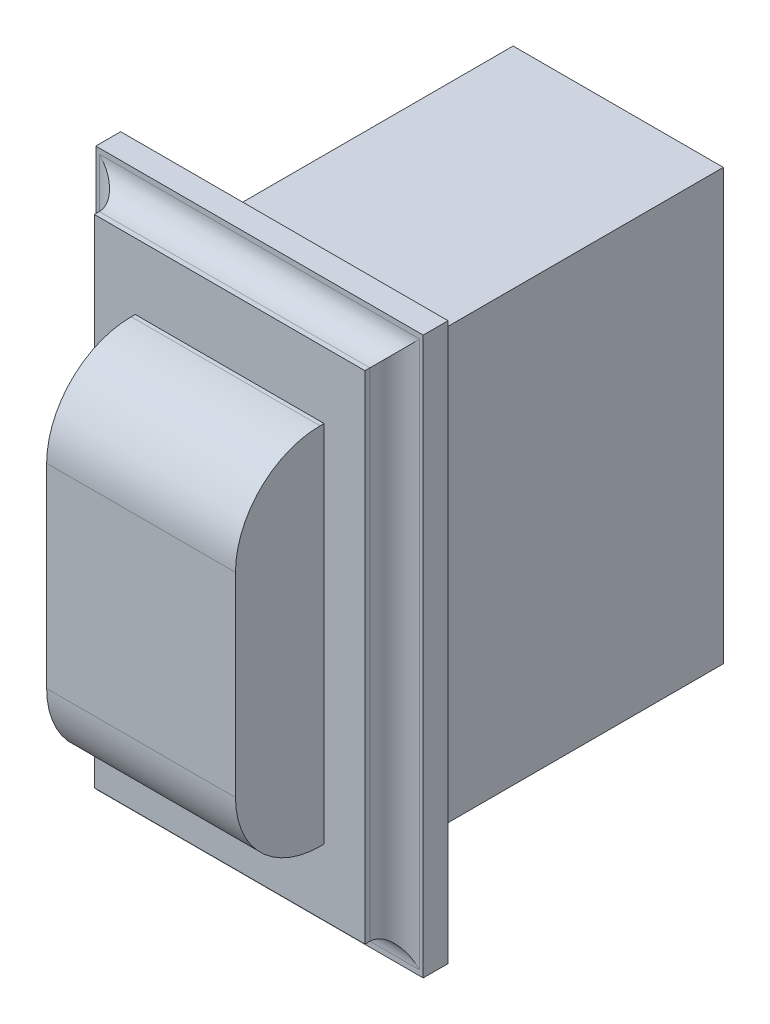
ISO-10303-21;
HEADER;
FILE_DESCRIPTION(('STEP AP214'),'2;1');
FILE_NAME('part.step','',(''),(''),'','','');
FILE_SCHEMA(('AUTOMOTIVE_DESIGN { 1 0 10303 214 1 1 1 1 }'));
ENDSEC;
DATA;
#1=APPLICATION_CONTEXT('core data for automotive mechanical design processes');
#2=APPLICATION_PROTOCOL_DEFINITION('international standard','automotive_design',2000,#1);
#3=PRODUCT_CONTEXT('',#1,'mechanical');
#4=PRODUCT('Part','Part','',(#3));
#5=PRODUCT_RELATED_PRODUCT_CATEGORY('part','',(#4));
#6=PRODUCT_DEFINITION_FORMATION('','',#4);
#7=PRODUCT_DEFINITION_CONTEXT('part definition',#1,'design');
#8=PRODUCT_DEFINITION('design','',#6,#7);
#9=PRODUCT_DEFINITION_SHAPE('','',#8);
#10=(LENGTH_UNIT() NAMED_UNIT(*) SI_UNIT(.MILLI.,.METRE.));
#11=(NAMED_UNIT(*) PLANE_ANGLE_UNIT() SI_UNIT($,.RADIAN.));
#12=(NAMED_UNIT(*) SI_UNIT($,.STERADIAN.) SOLID_ANGLE_UNIT());
#13=UNCERTAINTY_MEASURE_WITH_UNIT(LENGTH_MEASURE(1.E-05),#10,'distance_accuracy_value','');
#14=(GEOMETRIC_REPRESENTATION_CONTEXT(3) GLOBAL_UNCERTAINTY_ASSIGNED_CONTEXT((#13)) GLOBAL_UNIT_ASSIGNED_CONTEXT((#10,
#11,#12)) REPRESENTATION_CONTEXT('',''));
#15=CARTESIAN_POINT('',(0.,0.,0.));
#16=DIRECTION('',(0.,0.,1.));
#17=DIRECTION('',(1.,0.,0.));
#18=AXIS2_PLACEMENT_3D('',#15,#16,#17);
#19=CARTESIAN_POINT('',(0.,0.,0.));
#20=DIRECTION('',(0.,0.,1.));
#21=DIRECTION('',(1.,0.,0.));
#22=AXIS2_PLACEMENT_3D('',#19,#20,#21);
#23=PLANE('',#22);
#24=DIRECTION('',(0.,1.,0.));
#25=VECTOR('',#24,1.);
#26=CARTESIAN_POINT('',(16.7132,28.4226,0.));
#27=LINE('',#26,#25);
#28=CARTESIAN_POINT('',(16.7132,-28.4226,0.));
#29=VERTEX_POINT('',#28);
#30=CARTESIAN_POINT('',(16.7132,28.4226,0.));
#31=VERTEX_POINT('',#30);
#32=EDGE_CURVE('E248',#29,#31,#27,.T.);
#33=ORIENTED_EDGE('',*,*,#32,.F.);
#34=DIRECTION('',(1.,0.,0.));
#35=VECTOR('',#34,1.);
#36=CARTESIAN_POINT('',(-16.7132,-28.4226,0.));
#37=LINE('',#36,#35);
#38=CARTESIAN_POINT('',(-16.7132,-28.4226,0.));
#39=VERTEX_POINT('',#38);
#40=EDGE_CURVE('E253',#39,#29,#37,.T.);
#41=ORIENTED_EDGE('',*,*,#40,.F.);
#42=DIRECTION('',(0.,-1.,0.));
#43=VECTOR('',#42,1.);
#44=CARTESIAN_POINT('',(-16.7132,28.4226,0.));
#45=LINE('',#44,#43);
#46=CARTESIAN_POINT('',(-16.7132,28.4226,0.));
#47=VERTEX_POINT('',#46);
#48=EDGE_CURVE('E264',#47,#39,#45,.T.);
#49=ORIENTED_EDGE('',*,*,#48,.F.);
#50=DIRECTION('',(-1.,0.,0.));
#51=VECTOR('',#50,1.);
#52=CARTESIAN_POINT('',(-16.7132,28.4226,0.));
#53=LINE('',#52,#51);
#54=EDGE_CURVE('E262',#31,#47,#53,.T.);
#55=ORIENTED_EDGE('',*,*,#54,.F.);
#56=EDGE_LOOP('',(#33,#41,#49,#55));
#57=FACE_BOUND('',#56,.T.);
#58=DIRECTION('',(0.,1.,0.));
#59=VECTOR('',#58,1.);
#60=CARTESIAN_POINT('',(-10.7315,-21.9456,0.));
#61=LINE('',#60,#59);
#62=CARTESIAN_POINT('',(-10.7315,-21.9456,0.));
#63=VERTEX_POINT('',#62);
#64=CARTESIAN_POINT('',(-10.7315,21.9456,0.));
#65=VERTEX_POINT('',#64);
#66=EDGE_CURVE('E191',#63,#65,#61,.T.);
#67=ORIENTED_EDGE('',*,*,#66,.F.);
#68=DIRECTION('',(-1.,0.,0.));
#69=VECTOR('',#68,1.);
#70=CARTESIAN_POINT('',(10.7315,-21.9456,0.));
#71=LINE('',#70,#69);
#72=CARTESIAN_POINT('',(10.7315,-21.9456,0.));
#73=VERTEX_POINT('',#72);
#74=EDGE_CURVE('E188',#73,#63,#71,.T.);
#75=ORIENTED_EDGE('',*,*,#74,.F.);
#76=DIRECTION('',(0.,-1.,0.));
#77=VECTOR('',#76,1.);
#78=CARTESIAN_POINT('',(10.7315,-21.9456,0.));
#79=LINE('',#78,#77);
#80=CARTESIAN_POINT('',(10.7315,21.9456,0.));
#81=VERTEX_POINT('',#80);
#82=EDGE_CURVE('E55',#81,#73,#79,.T.);
#83=ORIENTED_EDGE('',*,*,#82,.F.);
#84=DIRECTION('',(1.,0.,0.));
#85=VECTOR('',#84,1.);
#86=CARTESIAN_POINT('',(10.7315,21.9456,0.));
#87=LINE('',#86,#85);
#88=EDGE_CURVE('E50',#65,#81,#87,.T.);
#89=ORIENTED_EDGE('',*,*,#88,.F.);
#90=EDGE_LOOP('',(#67,#75,#83,#89));
#91=FACE_BOUND('',#90,.T.);
#92=ADVANCED_FACE('F35',(#57,#91),#23,.F.);
#93=CARTESIAN_POINT('',(0.,0.,5.588));
#94=DIRECTION('',(0.,0.,1.));
#95=DIRECTION('',(1.,0.,0.));
#96=AXIS2_PLACEMENT_3D('',#93,#94,#95);
#97=PLANE('',#96);
#98=DIRECTION('',(0.,1.,0.));
#99=VECTOR('',#98,1.);
#100=CARTESIAN_POINT('',(13.8176,25.3492,5.588));
#101=LINE('',#100,#99);
#102=CARTESIAN_POINT('',(13.8176,-25.3492,5.588));
#103=VERTEX_POINT('',#102);
#104=CARTESIAN_POINT('',(13.8176,25.3492,5.588));
#105=VERTEX_POINT('',#104);
#106=EDGE_CURVE('E227',#103,#105,#101,.T.);
#107=ORIENTED_EDGE('',*,*,#106,.T.);
#108=DIRECTION('',(-1.,0.,0.));
#109=VECTOR('',#108,1.);
#110=CARTESIAN_POINT('',(-13.8176,25.3492,5.588));
#111=LINE('',#110,#109);
#112=CARTESIAN_POINT('',(-13.8176,25.3492,5.588));
#113=VERTEX_POINT('',#112);
#114=EDGE_CURVE('E230',#105,#113,#111,.T.);
#115=ORIENTED_EDGE('',*,*,#114,.T.);
#116=DIRECTION('',(0.,-1.,0.));
#117=VECTOR('',#116,1.);
#118=CARTESIAN_POINT('',(-13.8176,25.3492,5.588));
#119=LINE('',#118,#117);
#120=CARTESIAN_POINT('',(-13.8176,-25.3492,5.588));
#121=VERTEX_POINT('',#120);
#122=EDGE_CURVE('E232',#113,#121,#119,.T.);
#123=ORIENTED_EDGE('',*,*,#122,.T.);
#124=DIRECTION('',(1.,0.,0.));
#125=VECTOR('',#124,1.);
#126=CARTESIAN_POINT('',(-13.8176,-25.3492,5.588));
#127=LINE('',#126,#125);
#128=EDGE_CURVE('E234',#121,#103,#127,.T.);
#129=ORIENTED_EDGE('',*,*,#128,.T.);
#130=EDGE_LOOP('',(#107,#115,#123,#129));
#131=FACE_BOUND('',#130,.T.);
#132=DIRECTION('',(-1.,0.,0.));
#133=VECTOR('',#132,1.);
#134=CARTESIAN_POINT('',(-9.6393,18.5928,5.588));
#135=LINE('',#134,#133);
#136=CARTESIAN_POINT('',(9.6393,18.5928,5.588));
#137=VERTEX_POINT('',#136);
#138=CARTESIAN_POINT('',(-9.6393,18.5928,5.588));
#139=VERTEX_POINT('',#138);
#140=EDGE_CURVE('E211',#137,#139,#135,.T.);
#141=ORIENTED_EDGE('',*,*,#140,.F.);
#142=DIRECTION('',(0.,1.,0.));
#143=VECTOR('',#142,1.);
#144=CARTESIAN_POINT('',(9.6393,18.5928,5.588));
#145=LINE('',#144,#143);
#146=CARTESIAN_POINT('',(9.6393,-18.5928,5.588));
#147=VERTEX_POINT('',#146);
#148=EDGE_CURVE('E208',#147,#137,#145,.T.);
#149=ORIENTED_EDGE('',*,*,#148,.F.);
#150=DIRECTION('',(1.,0.,0.));
#151=VECTOR('',#150,1.);
#152=CARTESIAN_POINT('',(-9.6393,-18.5928,5.588));
#153=LINE('',#152,#151);
#154=CARTESIAN_POINT('',(-9.6393,-18.5928,5.588));
#155=VERTEX_POINT('',#154);
#156=EDGE_CURVE('E204',#155,#147,#153,.T.);
#157=ORIENTED_EDGE('',*,*,#156,.F.);
#158=DIRECTION('',(0.,-1.,0.));
#159=VECTOR('',#158,1.);
#160=CARTESIAN_POINT('',(-9.6393,18.5928,5.588));
#161=LINE('',#160,#159);
#162=EDGE_CURVE('E215',#139,#155,#161,.T.);
#163=ORIENTED_EDGE('',*,*,#162,.F.);
#164=EDGE_LOOP('',(#141,#149,#157,#163));
#165=FACE_BOUND('',#164,.T.);
#166=ADVANCED_FACE('F338',(#131,#165),#97,.T.);
#167=CARTESIAN_POINT('',(0.,0.,2.54));
#168=DIRECTION('',(0.,0.,1.));
#169=DIRECTION('',(1.,0.,0.));
#170=AXIS2_PLACEMENT_3D('',#167,#168,#169);
#171=PLANE('',#170);
#172=DIRECTION('',(0.,-1.,0.));
#173=VECTOR('',#172,1.);
#174=CARTESIAN_POINT('',(-16.3576,0.,2.54));
#175=LINE('',#174,#173);
#176=CARTESIAN_POINT('',(-16.3576,-27.8892,2.54));
#177=VERTEX_POINT('',#176);
#178=CARTESIAN_POINT('',(-16.3576,27.8892,2.54));
#179=VERTEX_POINT('',#178);
#180=EDGE_CURVE('E285',#177,#179,#175,.F.);
#181=ORIENTED_EDGE('',*,*,#180,.T.);
#182=DIRECTION('',(-1.,0.,0.));
#183=VECTOR('',#182,1.);
#184=CARTESIAN_POINT('',(0.,27.8892,2.54));
#185=LINE('',#184,#183);
#186=CARTESIAN_POINT('',(16.3576,27.8892,2.54));
#187=VERTEX_POINT('',#186);
#188=EDGE_CURVE('E287',#179,#187,#185,.F.);
#189=ORIENTED_EDGE('',*,*,#188,.T.);
#190=DIRECTION('',(0.,1.,0.));
#191=VECTOR('',#190,1.);
#192=CARTESIAN_POINT('',(16.3576,0.,2.54));
#193=LINE('',#192,#191);
#194=CARTESIAN_POINT('',(16.3576,-27.8892,2.54));
#195=VERTEX_POINT('',#194);
#196=EDGE_CURVE('E281',#187,#195,#193,.F.);
#197=ORIENTED_EDGE('',*,*,#196,.T.);
#198=DIRECTION('',(1.,0.,0.));
#199=VECTOR('',#198,1.);
#200=CARTESIAN_POINT('',(0.,-27.8892,2.54));
#201=LINE('',#200,#199);
#202=EDGE_CURVE('E283',#195,#177,#201,.F.);
#203=ORIENTED_EDGE('',*,*,#202,.T.);
#204=EDGE_LOOP('',(#181,#189,#197,#203));
#205=FACE_BOUND('',#204,.T.);
#206=DIRECTION('',(0.,1.,0.));
#207=VECTOR('',#206,1.);
#208=CARTESIAN_POINT('',(16.7132,28.4226,2.54));
#209=LINE('',#208,#207);
#210=CARTESIAN_POINT('',(16.7132,-28.4226,2.54));
#211=VERTEX_POINT('',#210);
#212=CARTESIAN_POINT('',(16.7132,28.4226,2.54));
#213=VERTEX_POINT('',#212);
#214=EDGE_CURVE('E249',#211,#213,#209,.T.);
#215=ORIENTED_EDGE('',*,*,#214,.T.);
#216=DIRECTION('',(-1.,0.,0.));
#217=VECTOR('',#216,1.);
#218=CARTESIAN_POINT('',(-16.7132,28.4226,2.54));
#219=LINE('',#218,#217);
#220=CARTESIAN_POINT('',(-16.7132,28.4226,2.54));
#221=VERTEX_POINT('',#220);
#222=EDGE_CURVE('E252',#213,#221,#219,.T.);
#223=ORIENTED_EDGE('',*,*,#222,.T.);
#224=DIRECTION('',(0.,-1.,0.));
#225=VECTOR('',#224,1.);
#226=CARTESIAN_POINT('',(-16.7132,28.4226,2.54));
#227=LINE('',#226,#225);
#228=CARTESIAN_POINT('',(-16.7132,-28.4226,2.54));
#229=VERTEX_POINT('',#228);
#230=EDGE_CURVE('E255',#221,#229,#227,.T.);
#231=ORIENTED_EDGE('',*,*,#230,.T.);
#232=DIRECTION('',(1.,0.,0.));
#233=VECTOR('',#232,1.);
#234=CARTESIAN_POINT('',(-16.7132,-28.4226,2.54));
#235=LINE('',#234,#233);
#236=EDGE_CURVE('E257',#229,#211,#235,.T.);
#237=ORIENTED_EDGE('',*,*,#236,.T.);
#238=EDGE_LOOP('',(#215,#223,#231,#237));
#239=FACE_BOUND('',#238,.T.);
#240=ADVANCED_FACE('F361',(#205,#239),#171,.T.);
#241=CARTESIAN_POINT('',(16.7132,28.4226,2.54));
#242=DIRECTION('',(-1.,0.,0.));
#243=DIRECTION('',(0.,-1.,0.));
#244=AXIS2_PLACEMENT_3D('',#241,#242,#243);
#245=PLANE('',#244);
#246=ORIENTED_EDGE('',*,*,#32,.T.);
#247=DIRECTION('',(0.,0.,-1.));
#248=VECTOR('',#247,1.);
#249=CARTESIAN_POINT('',(16.7132,28.4226,2.54));
#250=LINE('',#249,#248);
#251=EDGE_CURVE('E275',#213,#31,#250,.T.);
#252=ORIENTED_EDGE('',*,*,#251,.F.);
#253=ORIENTED_EDGE('',*,*,#214,.F.);
#254=DIRECTION('',(0.,0.,-1.));
#255=VECTOR('',#254,1.);
#256=CARTESIAN_POINT('',(16.7132,-28.4226,2.54));
#257=LINE('',#256,#255);
#258=EDGE_CURVE('E259',#211,#29,#257,.T.);
#259=ORIENTED_EDGE('',*,*,#258,.T.);
#260=EDGE_LOOP('',(#246,#252,#253,#259));
#261=FACE_BOUND('',#260,.T.);
#262=ADVANCED_FACE('F380',(#261),#245,.F.);
#263=CARTESIAN_POINT('',(-16.7132,28.4226,2.54));
#264=DIRECTION('',(0.,-1.,0.));
#265=DIRECTION('',(0.,0.,-1.));
#266=AXIS2_PLACEMENT_3D('',#263,#264,#265);
#267=PLANE('',#266);
#268=ORIENTED_EDGE('',*,*,#54,.T.);
#269=DIRECTION('',(0.,0.,-1.));
#270=VECTOR('',#269,1.);
#271=CARTESIAN_POINT('',(-16.7132,28.4226,2.54));
#272=LINE('',#271,#270);
#273=EDGE_CURVE('E272',#221,#47,#272,.T.);
#274=ORIENTED_EDGE('',*,*,#273,.F.);
#275=ORIENTED_EDGE('',*,*,#222,.F.);
#276=ORIENTED_EDGE('',*,*,#251,.T.);
#277=EDGE_LOOP('',(#268,#274,#275,#276));
#278=FACE_BOUND('',#277,.T.);
#279=ADVANCED_FACE('F376',(#278),#267,.F.);
#280=CARTESIAN_POINT('',(-16.7132,28.4226,2.54));
#281=DIRECTION('',(1.,0.,0.));
#282=DIRECTION('',(0.,1.,0.));
#283=AXIS2_PLACEMENT_3D('',#280,#281,#282);
#284=PLANE('',#283);
#285=ORIENTED_EDGE('',*,*,#48,.T.);
#286=DIRECTION('',(0.,0.,-1.));
#287=VECTOR('',#286,1.);
#288=CARTESIAN_POINT('',(-16.7132,-28.4226,2.54));
#289=LINE('',#288,#287);
#290=EDGE_CURVE('E269',#229,#39,#289,.T.);
#291=ORIENTED_EDGE('',*,*,#290,.F.);
#292=ORIENTED_EDGE('',*,*,#230,.F.);
#293=ORIENTED_EDGE('',*,*,#273,.T.);
#294=EDGE_LOOP('',(#285,#291,#292,#293));
#295=FACE_BOUND('',#294,.T.);
#296=ADVANCED_FACE('F372',(#295),#284,.F.);
#297=CARTESIAN_POINT('',(-16.7132,-28.4226,2.54));
#298=DIRECTION('',(0.,1.,0.));
#299=DIRECTION('',(0.,0.,1.));
#300=AXIS2_PLACEMENT_3D('',#297,#298,#299);
#301=PLANE('',#300);
#302=ORIENTED_EDGE('',*,*,#40,.T.);
#303=ORIENTED_EDGE('',*,*,#258,.F.);
#304=ORIENTED_EDGE('',*,*,#236,.F.);
#305=ORIENTED_EDGE('',*,*,#290,.T.);
#306=EDGE_LOOP('',(#302,#303,#304,#305));
#307=FACE_BOUND('',#306,.T.);
#308=ADVANCED_FACE('F368',(#307),#301,.F.);
#309=CARTESIAN_POINT('',(13.8176,25.3492,5.588));
#310=DIRECTION('',(-1.,0.,0.));
#311=DIRECTION('',(0.,-1.,0.));
#312=AXIS2_PLACEMENT_3D('',#309,#310,#311);
#313=PLANE('',#312);
#314=DIRECTION('',(0.,0.,-1.));
#315=VECTOR('',#314,1.);
#316=CARTESIAN_POINT('',(13.8176,-25.3492,5.588));
#317=LINE('',#316,#315);
#318=CARTESIAN_POINT('',(13.8176,-25.3492,5.08));
#319=VERTEX_POINT('',#318);
#320=EDGE_CURVE('E236',#103,#319,#317,.T.);
#321=ORIENTED_EDGE('',*,*,#320,.T.);
#322=DIRECTION('',(0.,1.,0.));
#323=VECTOR('',#322,1.);
#324=CARTESIAN_POINT('',(13.8176,25.3492,5.08));
#325=LINE('',#324,#323);
#326=CARTESIAN_POINT('',(13.8176,25.3492,5.08));
#327=VERTEX_POINT('',#326);
#328=EDGE_CURVE('E294',#319,#327,#325,.T.);
#329=ORIENTED_EDGE('',*,*,#328,.T.);
#330=DIRECTION('',(0.,0.,-1.));
#331=VECTOR('',#330,1.);
#332=CARTESIAN_POINT('',(13.8176,25.3492,5.588));
#333=LINE('',#332,#331);
#334=EDGE_CURVE('E245',#105,#327,#333,.T.);
#335=ORIENTED_EDGE('',*,*,#334,.F.);
#336=ORIENTED_EDGE('',*,*,#106,.F.);
#337=EDGE_LOOP('',(#321,#329,#335,#336));
#338=FACE_BOUND('',#337,.T.);
#339=ADVANCED_FACE('F371',(#338),#313,.F.);
#340=CARTESIAN_POINT('',(-13.8176,25.3492,5.588));
#341=DIRECTION('',(0.,-1.,0.));
#342=DIRECTION('',(0.,0.,-1.));
#343=AXIS2_PLACEMENT_3D('',#340,#341,#342);
#344=PLANE('',#343);
#345=ORIENTED_EDGE('',*,*,#334,.T.);
#346=DIRECTION('',(-1.,0.,0.));
#347=VECTOR('',#346,1.);
#348=CARTESIAN_POINT('',(-13.8176,25.3492,5.08));
#349=LINE('',#348,#347);
#350=CARTESIAN_POINT('',(-13.8176,25.3492,5.08));
#351=VERTEX_POINT('',#350);
#352=EDGE_CURVE('E278',#327,#351,#349,.T.);
#353=ORIENTED_EDGE('',*,*,#352,.T.);
#354=DIRECTION('',(0.,0.,-1.));
#355=VECTOR('',#354,1.);
#356=CARTESIAN_POINT('',(-13.8176,25.3492,5.588));
#357=LINE('',#356,#355);
#358=EDGE_CURVE('E242',#113,#351,#357,.T.);
#359=ORIENTED_EDGE('',*,*,#358,.F.);
#360=ORIENTED_EDGE('',*,*,#114,.F.);
#361=EDGE_LOOP('',(#345,#353,#359,#360));
#362=FACE_BOUND('',#361,.T.);
#363=ADVANCED_FACE('F552',(#362),#344,.F.);
#364=CARTESIAN_POINT('',(-13.8176,25.3492,5.588));
#365=DIRECTION('',(1.,0.,0.));
#366=DIRECTION('',(0.,1.,0.));
#367=AXIS2_PLACEMENT_3D('',#364,#365,#366);
#368=PLANE('',#367);
#369=ORIENTED_EDGE('',*,*,#358,.T.);
#370=DIRECTION('',(0.,-1.,0.));
#371=VECTOR('',#370,1.);
#372=CARTESIAN_POINT('',(-13.8176,25.3492,5.08));
#373=LINE('',#372,#371);
#374=CARTESIAN_POINT('',(-13.8176,-25.3492,5.08));
#375=VERTEX_POINT('',#374);
#376=EDGE_CURVE('E290',#351,#375,#373,.T.);
#377=ORIENTED_EDGE('',*,*,#376,.T.);
#378=DIRECTION('',(0.,0.,-1.));
#379=VECTOR('',#378,1.);
#380=CARTESIAN_POINT('',(-13.8176,-25.3492,5.588));
#381=LINE('',#380,#379);
#382=EDGE_CURVE('E239',#121,#375,#381,.T.);
#383=ORIENTED_EDGE('',*,*,#382,.F.);
#384=ORIENTED_EDGE('',*,*,#122,.F.);
#385=EDGE_LOOP('',(#369,#377,#383,#384));
#386=FACE_BOUND('',#385,.T.);
#387=ADVANCED_FACE('F544',(#386),#368,.F.);
#388=CARTESIAN_POINT('',(-13.8176,-25.3492,5.588));
#389=DIRECTION('',(0.,1.,0.));
#390=DIRECTION('',(0.,0.,1.));
#391=AXIS2_PLACEMENT_3D('',#388,#389,#390);
#392=PLANE('',#391);
#393=ORIENTED_EDGE('',*,*,#382,.T.);
#394=DIRECTION('',(1.,0.,0.));
#395=VECTOR('',#394,1.);
#396=CARTESIAN_POINT('',(-13.8176,-25.3492,5.08));
#397=LINE('',#396,#395);
#398=EDGE_CURVE('E292',#375,#319,#397,.T.);
#399=ORIENTED_EDGE('',*,*,#398,.T.);
#400=ORIENTED_EDGE('',*,*,#320,.F.);
#401=ORIENTED_EDGE('',*,*,#128,.F.);
#402=EDGE_LOOP('',(#393,#399,#400,#401));
#403=FACE_BOUND('',#402,.T.);
#404=ADVANCED_FACE('F353',(#403),#392,.F.);
#405=CARTESIAN_POINT('',(9.6393,18.5928,14.6304));
#406=DIRECTION('',(-1.,0.,0.));
#407=DIRECTION('',(0.,-1.,0.));
#408=AXIS2_PLACEMENT_3D('',#405,#406,#407);
#409=PLANE('',#408);
#410=DIRECTION('',(0.,1.,0.));
#411=VECTOR('',#410,1.);
#412=CARTESIAN_POINT('',(9.6393,18.5928,14.6304));
#413=LINE('',#412,#411);
#414=CARTESIAN_POINT('',(9.6393,-9.95679999999999,14.6304));
#415=VERTEX_POINT('',#414);
#416=CARTESIAN_POINT('',(9.6393,9.9568,14.6304));
#417=VERTEX_POINT('',#416);
#418=EDGE_CURVE('E200',#415,#417,#413,.T.);
#419=ORIENTED_EDGE('',*,*,#418,.F.);
#420=CARTESIAN_POINT('',(9.6393,-9.9568,5.9944));
#421=DIRECTION('',(-1.,0.,0.));
#422=DIRECTION('',(0.,-1.,0.));
#423=AXIS2_PLACEMENT_3D('',#420,#421,#422);
#424=CIRCLE('',#423,8.636);
#425=CARTESIAN_POINT('',(9.6393,-18.5928,5.9944));
#426=VERTEX_POINT('',#425);
#427=EDGE_CURVE('E310',#415,#426,#424,.F.);
#428=ORIENTED_EDGE('',*,*,#427,.T.);
#429=DIRECTION('',(0.,0.,-1.));
#430=VECTOR('',#429,1.);
#431=CARTESIAN_POINT('',(9.6393,-18.5928,14.6304));
#432=LINE('',#431,#430);
#433=EDGE_CURVE('E207',#426,#147,#432,.T.);
#434=ORIENTED_EDGE('',*,*,#433,.T.);
#435=ORIENTED_EDGE('',*,*,#148,.T.);
#436=DIRECTION('',(0.,0.,-1.));
#437=VECTOR('',#436,1.);
#438=CARTESIAN_POINT('',(9.6393,18.5928,14.6304));
#439=LINE('',#438,#437);
#440=CARTESIAN_POINT('',(9.6393,18.5928,5.9944));
#441=VERTEX_POINT('',#440);
#442=EDGE_CURVE('E225',#441,#137,#439,.T.);
#443=ORIENTED_EDGE('',*,*,#442,.F.);
#444=CARTESIAN_POINT('',(9.6393,9.95679999999999,5.9944));
#445=DIRECTION('',(-1.,0.,0.));
#446=DIRECTION('',(0.,-1.,0.));
#447=AXIS2_PLACEMENT_3D('',#444,#445,#446);
#448=CIRCLE('',#447,8.636);
#449=EDGE_CURVE('E308',#441,#417,#448,.F.);
#450=ORIENTED_EDGE('',*,*,#449,.T.);
#451=EDGE_LOOP('',(#419,#428,#434,#435,#443,#450));
#452=FACE_BOUND('',#451,.T.);
#453=ADVANCED_FACE('F330',(#452),#409,.F.);
#454=CARTESIAN_POINT('',(-9.6393,18.5928,14.6304));
#455=DIRECTION('',(0.,-1.,0.));
#456=DIRECTION('',(0.,0.,-1.));
#457=AXIS2_PLACEMENT_3D('',#454,#455,#456);
#458=PLANE('',#457);
#459=DIRECTION('',(0.,0.,-1.));
#460=VECTOR('',#459,1.);
#461=CARTESIAN_POINT('',(-9.6393,18.5928,14.6304));
#462=LINE('',#461,#460);
#463=CARTESIAN_POINT('',(-9.6393,18.5928,5.9944));
#464=VERTEX_POINT('',#463);
#465=EDGE_CURVE('E223',#464,#139,#462,.T.);
#466=ORIENTED_EDGE('',*,*,#465,.F.);
#467=DIRECTION('',(-1.,0.,0.));
#468=VECTOR('',#467,1.);
#469=CARTESIAN_POINT('',(9.6393,18.5928,5.9944));
#470=LINE('',#469,#468);
#471=EDGE_CURVE('E11',#464,#441,#470,.F.);
#472=ORIENTED_EDGE('',*,*,#471,.T.);
#473=ORIENTED_EDGE('',*,*,#442,.T.);
#474=ORIENTED_EDGE('',*,*,#140,.T.);
#475=EDGE_LOOP('',(#466,#472,#473,#474));
#476=FACE_BOUND('',#475,.T.);
#477=ADVANCED_FACE('F345',(#476),#458,.F.);
#478=CARTESIAN_POINT('',(-9.6393,18.5928,14.6304));
#479=DIRECTION('',(1.,0.,0.));
#480=DIRECTION('',(0.,1.,0.));
#481=AXIS2_PLACEMENT_3D('',#478,#479,#480);
#482=PLANE('',#481);
#483=DIRECTION('',(0.,0.,-1.));
#484=VECTOR('',#483,1.);
#485=CARTESIAN_POINT('',(-9.6393,-18.5928,14.6304));
#486=LINE('',#485,#484);
#487=CARTESIAN_POINT('',(-9.6393,-18.5928,5.9944));
#488=VERTEX_POINT('',#487);
#489=EDGE_CURVE('E221',#488,#155,#486,.T.);
#490=ORIENTED_EDGE('',*,*,#489,.F.);
#491=CARTESIAN_POINT('',(-9.6393,-9.9568,5.9944));
#492=DIRECTION('',(1.,0.,0.));
#493=DIRECTION('',(0.,1.,0.));
#494=AXIS2_PLACEMENT_3D('',#491,#492,#493);
#495=CIRCLE('',#494,8.636);
#496=CARTESIAN_POINT('',(-9.6393,-9.95679999999999,14.6304));
#497=VERTEX_POINT('',#496);
#498=EDGE_CURVE('E43',#488,#497,#495,.F.);
#499=ORIENTED_EDGE('',*,*,#498,.T.);
#500=DIRECTION('',(0.,-1.,0.));
#501=VECTOR('',#500,1.);
#502=CARTESIAN_POINT('',(-9.6393,18.5928,14.6304));
#503=LINE('',#502,#501);
#504=CARTESIAN_POINT('',(-9.6393,9.9568,14.6304));
#505=VERTEX_POINT('',#504);
#506=EDGE_CURVE('E203',#505,#497,#503,.T.);
#507=ORIENTED_EDGE('',*,*,#506,.F.);
#508=CARTESIAN_POINT('',(-9.6393,9.95679999999999,5.9944));
#509=DIRECTION('',(1.,0.,0.));
#510=DIRECTION('',(0.,1.,0.));
#511=AXIS2_PLACEMENT_3D('',#508,#509,#510);
#512=CIRCLE('',#511,8.636);
#513=EDGE_CURVE('E314',#505,#464,#512,.F.);
#514=ORIENTED_EDGE('',*,*,#513,.T.);
#515=ORIENTED_EDGE('',*,*,#465,.T.);
#516=ORIENTED_EDGE('',*,*,#162,.T.);
#517=EDGE_LOOP('',(#490,#499,#507,#514,#515,#516));
#518=FACE_BOUND('',#517,.T.);
#519=ADVANCED_FACE('F319',(#518),#482,.F.);
#520=CARTESIAN_POINT('',(-9.6393,-18.5928,14.6304));
#521=DIRECTION('',(0.,1.,0.));
#522=DIRECTION('',(0.,0.,1.));
#523=AXIS2_PLACEMENT_3D('',#520,#521,#522);
#524=PLANE('',#523);
#525=ORIENTED_EDGE('',*,*,#433,.F.);
#526=DIRECTION('',(1.,0.,0.));
#527=VECTOR('',#526,1.);
#528=CARTESIAN_POINT('',(-9.6393,-18.5928,5.9944));
#529=LINE('',#528,#527);
#530=EDGE_CURVE('E312',#426,#488,#529,.F.);
#531=ORIENTED_EDGE('',*,*,#530,.T.);
#532=ORIENTED_EDGE('',*,*,#489,.T.);
#533=ORIENTED_EDGE('',*,*,#156,.T.);
#534=EDGE_LOOP('',(#525,#531,#532,#533));
#535=FACE_BOUND('',#534,.T.);
#536=ADVANCED_FACE('F332',(#535),#524,.F.);
#537=CARTESIAN_POINT('',(0.,0.,14.6304));
#538=DIRECTION('',(0.,0.,1.));
#539=DIRECTION('',(1.,0.,0.));
#540=AXIS2_PLACEMENT_3D('',#537,#538,#539);
#541=PLANE('',#540);
#542=ORIENTED_EDGE('',*,*,#506,.T.);
#543=DIRECTION('',(1.,0.,0.));
#544=VECTOR('',#543,1.);
#545=CARTESIAN_POINT('',(9.6393,-9.9568,14.6304));
#546=LINE('',#545,#544);
#547=EDGE_CURVE('E305',#497,#415,#546,.T.);
#548=ORIENTED_EDGE('',*,*,#547,.T.);
#549=ORIENTED_EDGE('',*,*,#418,.T.);
#550=DIRECTION('',(-1.,0.,0.));
#551=VECTOR('',#550,1.);
#552=CARTESIAN_POINT('',(-9.6393,9.95679999999999,14.6304));
#553=LINE('',#552,#551);
#554=EDGE_CURVE('E295',#417,#505,#553,.T.);
#555=ORIENTED_EDGE('',*,*,#554,.T.);
#556=EDGE_LOOP('',(#542,#548,#549,#555));
#557=FACE_BOUND('',#556,.T.);
#558=ADVANCED_FACE('F324',(#557),#541,.T.);
#559=CARTESIAN_POINT('',(-13.8176,-27.8892,5.08));
#560=DIRECTION('',(1.,0.,0.));
#561=DIRECTION('',(0.,0.,-1.));
#562=AXIS2_PLACEMENT_3D('',#559,#560,#561);
#563=CYLINDRICAL_SURFACE('',#562,2.54);
#564=CARTESIAN_POINT('',(-16.3576,-27.8892,5.08));
#565=DIRECTION('',(0.707106781186548,-0.707106781186547,0.));
#566=DIRECTION('',(0.707106781186547,0.707106781186548,0.));
#567=AXIS2_PLACEMENT_3D('',#564,#565,#566);
#568=ELLIPSE('',#567,3.59210244842766,2.54);
#569=EDGE_CURVE('E298',#177,#375,#568,.T.);
#570=ORIENTED_EDGE('',*,*,#569,.F.);
#571=ORIENTED_EDGE('',*,*,#202,.F.);
#572=CARTESIAN_POINT('',(16.3576,-27.8892,5.08));
#573=DIRECTION('',(0.707106781186547,0.707106781186548,0.));
#574=DIRECTION('',(-0.707106781186547,0.707106781186547,0.));
#575=AXIS2_PLACEMENT_3D('',#572,#573,#574);
#576=ELLIPSE('',#575,3.59210244842766,2.54);
#577=EDGE_CURVE('E212',#319,#195,#576,.F.);
#578=ORIENTED_EDGE('',*,*,#577,.F.);
#579=ORIENTED_EDGE('',*,*,#398,.F.);
#580=EDGE_LOOP('',(#570,#571,#578,#579));
#581=FACE_BOUND('',#580,.T.);
#582=ADVANCED_FACE('F396',(#581),#563,.F.);
#583=CARTESIAN_POINT('',(16.3576,25.3492,5.08));
#584=DIRECTION('',(0.,1.,0.));
#585=DIRECTION('',(-1.,0.,0.));
#586=AXIS2_PLACEMENT_3D('',#583,#584,#585);
#587=CYLINDRICAL_SURFACE('',#586,2.54);
#588=ORIENTED_EDGE('',*,*,#577,.T.);
#589=ORIENTED_EDGE('',*,*,#196,.F.);
#590=CARTESIAN_POINT('',(16.3576,27.8892,5.08));
#591=DIRECTION('',(-0.707106781186547,0.707106781186547,0.));
#592=DIRECTION('',(0.707106781186547,0.707106781186548,0.));
#593=AXIS2_PLACEMENT_3D('',#590,#591,#592);
#594=ELLIPSE('',#593,3.59210244842766,2.54);
#595=EDGE_CURVE('E194',#327,#187,#594,.F.);
#596=ORIENTED_EDGE('',*,*,#595,.F.);
#597=ORIENTED_EDGE('',*,*,#328,.F.);
#598=EDGE_LOOP('',(#588,#589,#596,#597));
#599=FACE_BOUND('',#598,.T.);
#600=ADVANCED_FACE('F392',(#599),#587,.F.);
#601=CARTESIAN_POINT('',(-16.3576,25.3492,5.08));
#602=DIRECTION('',(0.,-1.,0.));
#603=DIRECTION('',(1.,0.,0.));
#604=AXIS2_PLACEMENT_3D('',#601,#602,#603);
#605=CYLINDRICAL_SURFACE('',#604,2.54);
#606=ORIENTED_EDGE('',*,*,#569,.T.);
#607=ORIENTED_EDGE('',*,*,#376,.F.);
#608=CARTESIAN_POINT('',(-16.3576,27.8892,5.08));
#609=DIRECTION('',(-0.707106781186547,-0.707106781186548,0.));
#610=DIRECTION('',(0.707106781186548,-0.707106781186547,0.));
#611=AXIS2_PLACEMENT_3D('',#608,#609,#610);
#612=ELLIPSE('',#611,3.59210244842766,2.54);
#613=EDGE_CURVE('E192',#179,#351,#612,.T.);
#614=ORIENTED_EDGE('',*,*,#613,.F.);
#615=ORIENTED_EDGE('',*,*,#180,.F.);
#616=EDGE_LOOP('',(#606,#607,#614,#615));
#617=FACE_BOUND('',#616,.T.);
#618=ADVANCED_FACE('F388',(#617),#605,.F.);
#619=CARTESIAN_POINT('',(-13.8176,27.8892,5.08));
#620=DIRECTION('',(-1.,0.,0.));
#621=DIRECTION('',(0.,0.,1.));
#622=AXIS2_PLACEMENT_3D('',#619,#620,#621);
#623=CYLINDRICAL_SURFACE('',#622,2.54);
#624=ORIENTED_EDGE('',*,*,#595,.T.);
#625=ORIENTED_EDGE('',*,*,#188,.F.);
#626=ORIENTED_EDGE('',*,*,#613,.T.);
#627=ORIENTED_EDGE('',*,*,#352,.F.);
#628=EDGE_LOOP('',(#624,#625,#626,#627));
#629=FACE_BOUND('',#628,.T.);
#630=ADVANCED_FACE('F385',(#629),#623,.F.);
#631=CARTESIAN_POINT('',(0.,-9.9568,5.9944));
#632=DIRECTION('',(-1.,0.,0.));
#633=DIRECTION('',(0.,0.,1.));
#634=AXIS2_PLACEMENT_3D('',#631,#632,#633);
#635=CYLINDRICAL_SURFACE('',#634,8.636);
#636=ORIENTED_EDGE('',*,*,#498,.F.);
#637=ORIENTED_EDGE('',*,*,#530,.F.);
#638=ORIENTED_EDGE('',*,*,#427,.F.);
#639=ORIENTED_EDGE('',*,*,#547,.F.);
#640=EDGE_LOOP('',(#636,#637,#638,#639));
#641=FACE_BOUND('',#640,.T.);
#642=ADVANCED_FACE('F327',(#641),#635,.T.);
#643=CARTESIAN_POINT('',(0.,9.95679999999999,5.9944));
#644=DIRECTION('',(1.,0.,0.));
#645=DIRECTION('',(0.,0.,-1.));
#646=AXIS2_PLACEMENT_3D('',#643,#644,#645);
#647=CYLINDRICAL_SURFACE('',#646,8.636);
#648=ORIENTED_EDGE('',*,*,#449,.F.);
#649=ORIENTED_EDGE('',*,*,#471,.F.);
#650=ORIENTED_EDGE('',*,*,#513,.F.);
#651=ORIENTED_EDGE('',*,*,#554,.F.);
#652=EDGE_LOOP('',(#648,#649,#650,#651));
#653=FACE_BOUND('',#652,.T.);
#654=ADVANCED_FACE('F37',(#653),#647,.T.);
#655=CARTESIAN_POINT('',(-10.7315,-21.9456,-34.0868));
#656=DIRECTION('',(1.,0.,0.));
#657=DIRECTION('',(0.,0.,-1.));
#658=AXIS2_PLACEMENT_3D('',#655,#656,#657);
#659=PLANE('',#658);
#660=ORIENTED_EDGE('',*,*,#66,.T.);
#661=DIRECTION('',(0.,0.,1.));
#662=VECTOR('',#661,1.);
#663=CARTESIAN_POINT('',(-10.7315,21.9456,-34.0868));
#664=LINE('',#663,#662);
#665=CARTESIAN_POINT('',(-10.7315,21.9456,-34.0868));
#666=VERTEX_POINT('',#665);
#667=EDGE_CURVE('E172',#666,#65,#664,.T.);
#668=ORIENTED_EDGE('',*,*,#667,.F.);
#669=DIRECTION('',(0.,1.,0.));
#670=VECTOR('',#669,1.);
#671=CARTESIAN_POINT('',(-10.7315,-21.9456,-34.0868));
#672=LINE('',#671,#670);
#673=CARTESIAN_POINT('',(-10.7315,-21.9456,-34.0868));
#674=VERTEX_POINT('',#673);
#675=EDGE_CURVE('E179',#674,#666,#672,.T.);
#676=ORIENTED_EDGE('',*,*,#675,.F.);
#677=DIRECTION('',(0.,0.,1.));
#678=VECTOR('',#677,1.);
#679=CARTESIAN_POINT('',(-10.7315,-21.9456,-34.0868));
#680=LINE('',#679,#678);
#681=EDGE_CURVE('E517',#674,#63,#680,.T.);
#682=ORIENTED_EDGE('',*,*,#681,.T.);
#683=EDGE_LOOP('',(#660,#668,#676,#682));
#684=FACE_BOUND('',#683,.T.);
#685=ADVANCED_FACE('F190',(#684),#659,.F.);
#686=CARTESIAN_POINT('',(10.7315,21.9456,-34.0868));
#687=DIRECTION('',(0.,-1.,0.));
#688=DIRECTION('',(0.,0.,-1.));
#689=AXIS2_PLACEMENT_3D('',#686,#687,#688);
#690=PLANE('',#689);
#691=ORIENTED_EDGE('',*,*,#88,.T.);
#692=DIRECTION('',(0.,0.,1.));
#693=VECTOR('',#692,1.);
#694=CARTESIAN_POINT('',(10.7315,21.9456,-34.0868));
#695=LINE('',#694,#693);
#696=CARTESIAN_POINT('',(10.7315,21.9456,-34.0868));
#697=VERTEX_POINT('',#696);
#698=EDGE_CURVE('E175',#697,#81,#695,.T.);
#699=ORIENTED_EDGE('',*,*,#698,.F.);
#700=DIRECTION('',(1.,0.,0.));
#701=VECTOR('',#700,1.);
#702=CARTESIAN_POINT('',(10.7315,21.9456,-34.0868));
#703=LINE('',#702,#701);
#704=EDGE_CURVE('E168',#666,#697,#703,.T.);
#705=ORIENTED_EDGE('',*,*,#704,.F.);
#706=ORIENTED_EDGE('',*,*,#667,.T.);
#707=EDGE_LOOP('',(#691,#699,#705,#706));
#708=FACE_BOUND('',#707,.T.);
#709=ADVANCED_FACE('F170',(#708),#690,.F.);
#710=CARTESIAN_POINT('',(10.7315,-21.9456,-34.0868));
#711=DIRECTION('',(-1.,0.,0.));
#712=DIRECTION('',(0.,0.,1.));
#713=AXIS2_PLACEMENT_3D('',#710,#711,#712);
#714=PLANE('',#713);
#715=ORIENTED_EDGE('',*,*,#82,.T.);
#716=DIRECTION('',(0.,0.,1.));
#717=VECTOR('',#716,1.);
#718=CARTESIAN_POINT('',(10.7315,-21.9456,-34.0868));
#719=LINE('',#718,#717);
#720=CARTESIAN_POINT('',(10.7315,-21.9456,-34.0868));
#721=VERTEX_POINT('',#720);
#722=EDGE_CURVE('E196',#721,#73,#719,.T.);
#723=ORIENTED_EDGE('',*,*,#722,.F.);
#724=DIRECTION('',(0.,-1.,0.));
#725=VECTOR('',#724,1.);
#726=CARTESIAN_POINT('',(10.7315,-21.9456,-34.0868));
#727=LINE('',#726,#725);
#728=EDGE_CURVE('E178',#697,#721,#727,.T.);
#729=ORIENTED_EDGE('',*,*,#728,.F.);
#730=ORIENTED_EDGE('',*,*,#698,.T.);
#731=EDGE_LOOP('',(#715,#723,#729,#730));
#732=FACE_BOUND('',#731,.T.);
#733=ADVANCED_FACE('F411',(#732),#714,.F.);
#734=CARTESIAN_POINT('',(10.7315,-21.9456,-34.0868));
#735=DIRECTION('',(0.,1.,0.));
#736=DIRECTION('',(0.,0.,1.));
#737=AXIS2_PLACEMENT_3D('',#734,#735,#736);
#738=PLANE('',#737);
#739=ORIENTED_EDGE('',*,*,#74,.T.);
#740=ORIENTED_EDGE('',*,*,#681,.F.);
#741=DIRECTION('',(-1.,0.,0.));
#742=VECTOR('',#741,1.);
#743=CARTESIAN_POINT('',(10.7315,-21.9456,-34.0868));
#744=LINE('',#743,#742);
#745=EDGE_CURVE('E184',#721,#674,#744,.T.);
#746=ORIENTED_EDGE('',*,*,#745,.F.);
#747=ORIENTED_EDGE('',*,*,#722,.T.);
#748=EDGE_LOOP('',(#739,#740,#746,#747));
#749=FACE_BOUND('',#748,.T.);
#750=ADVANCED_FACE('F494',(#749),#738,.F.);
#751=CARTESIAN_POINT('',(0.,0.,-34.0868));
#752=DIRECTION('',(0.,0.,1.));
#753=DIRECTION('',(1.,0.,0.));
#754=AXIS2_PLACEMENT_3D('',#751,#752,#753);
#755=PLANE('',#754);
#756=ORIENTED_EDGE('',*,*,#675,.T.);
#757=ORIENTED_EDGE('',*,*,#704,.T.);
#758=ORIENTED_EDGE('',*,*,#728,.T.);
#759=ORIENTED_EDGE('',*,*,#745,.T.);
#760=EDGE_LOOP('',(#756,#757,#758,#759));
#761=FACE_BOUND('',#760,.T.);
#762=ADVANCED_FACE('F182',(#761),#755,.F.);
#763=CLOSED_SHELL('',(#92,#166,#240,#262,#279,#296,#308,#339,#363,#387,#404,#453,#477,#519,#536,
#558,#582,#600,#618,#630,#642,#654,#685,#709,#733,#750,#762));
#764=MANIFOLD_SOLID_BREP('B2',#763);
#765=ADVANCED_BREP_SHAPE_REPRESENTATION('',(#18,#764),#14);
#766=SHAPE_DEFINITION_REPRESENTATION(#9,#765);
ENDSEC;
END-ISO-10303-21;
